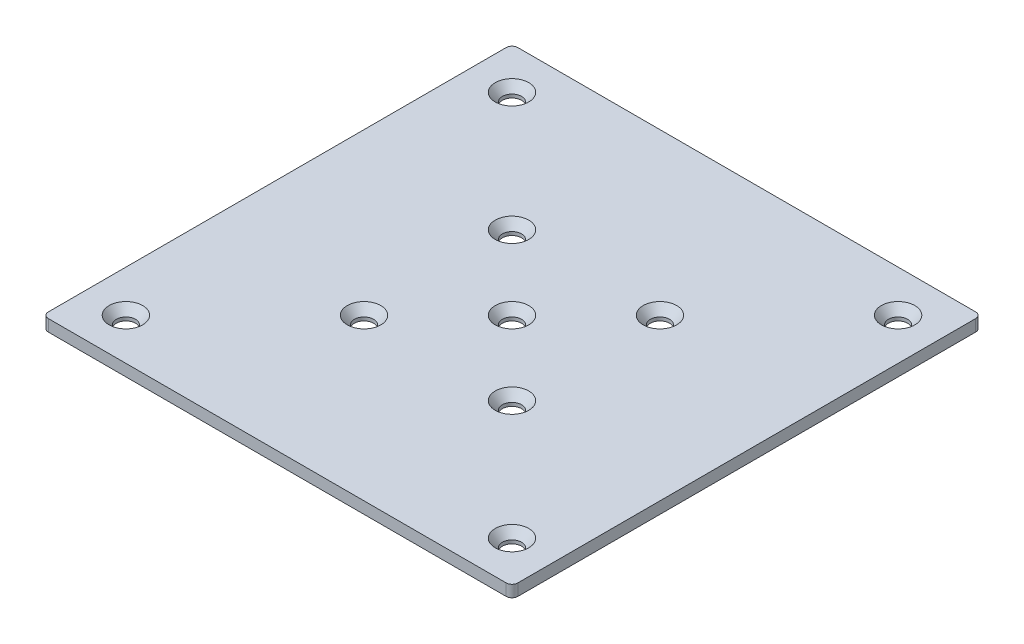
ISO-10303-21;
HEADER;
FILE_DESCRIPTION(('STEP AP214'),'2;1');
FILE_NAME('part.step','',(''),(''),'','','');
FILE_SCHEMA(('AUTOMOTIVE_DESIGN { 1 0 10303 214 1 1 1 1 }'));
ENDSEC;
DATA;
#1=APPLICATION_CONTEXT('core data for automotive mechanical design processes');
#2=APPLICATION_PROTOCOL_DEFINITION('international standard','automotive_design',2000,#1);
#3=PRODUCT_CONTEXT('',#1,'mechanical');
#4=PRODUCT('Part','Part','',(#3));
#5=PRODUCT_RELATED_PRODUCT_CATEGORY('part','',(#4));
#6=PRODUCT_DEFINITION_FORMATION('','',#4);
#7=PRODUCT_DEFINITION_CONTEXT('part definition',#1,'design');
#8=PRODUCT_DEFINITION('design','',#6,#7);
#9=PRODUCT_DEFINITION_SHAPE('','',#8);
#10=(LENGTH_UNIT() NAMED_UNIT(*) SI_UNIT(.MILLI.,.METRE.));
#11=(NAMED_UNIT(*) PLANE_ANGLE_UNIT() SI_UNIT($,.RADIAN.));
#12=(NAMED_UNIT(*) SI_UNIT($,.STERADIAN.) SOLID_ANGLE_UNIT());
#13=UNCERTAINTY_MEASURE_WITH_UNIT(LENGTH_MEASURE(1.E-05),#10,'distance_accuracy_value','');
#14=(GEOMETRIC_REPRESENTATION_CONTEXT(3) GLOBAL_UNCERTAINTY_ASSIGNED_CONTEXT((#13)) GLOBAL_UNIT_ASSIGNED_CONTEXT((#10,
#11,#12)) REPRESENTATION_CONTEXT('',''));
#15=CARTESIAN_POINT('',(0.,0.,0.));
#16=DIRECTION('',(0.,0.,1.));
#17=DIRECTION('',(1.,0.,0.));
#18=AXIS2_PLACEMENT_3D('',#15,#16,#17);
#19=CARTESIAN_POINT('',(40.,2.,40.));
#20=DIRECTION('',(-1.,0.,0.));
#21=DIRECTION('',(0.,0.,1.));
#22=AXIS2_PLACEMENT_3D('',#19,#20,#21);
#23=PLANE('',#22);
#24=DIRECTION('',(0.,0.,-1.));
#25=VECTOR('',#24,1.);
#26=CARTESIAN_POINT('',(40.,2.,40.));
#27=LINE('',#26,#25);
#28=CARTESIAN_POINT('',(40.,2.,39.));
#29=VERTEX_POINT('',#28);
#30=CARTESIAN_POINT('',(40.,2.,-39.));
#31=VERTEX_POINT('',#30);
#32=EDGE_CURVE('E123',#29,#31,#27,.T.);
#33=ORIENTED_EDGE('',*,*,#32,.F.);
#34=DIRECTION('',(0.,-1.,0.));
#35=VECTOR('',#34,1.);
#36=CARTESIAN_POINT('',(40.,2.,39.));
#37=LINE('',#36,#35);
#38=CARTESIAN_POINT('',(40.,0.,39.));
#39=VERTEX_POINT('',#38);
#40=EDGE_CURVE('E137',#29,#39,#37,.T.);
#41=ORIENTED_EDGE('',*,*,#40,.T.);
#42=DIRECTION('',(0.,0.,-1.));
#43=VECTOR('',#42,1.);
#44=CARTESIAN_POINT('',(40.,0.,40.));
#45=LINE('',#44,#43);
#46=CARTESIAN_POINT('',(40.,0.,-39.));
#47=VERTEX_POINT('',#46);
#48=EDGE_CURVE('E158',#39,#47,#45,.T.);
#49=ORIENTED_EDGE('',*,*,#48,.T.);
#50=DIRECTION('',(0.,-1.,0.));
#51=VECTOR('',#50,1.);
#52=CARTESIAN_POINT('',(40.,2.,-39.));
#53=LINE('',#52,#51);
#54=EDGE_CURVE('E135',#47,#31,#53,.F.);
#55=ORIENTED_EDGE('',*,*,#54,.T.);
#56=EDGE_LOOP('',(#33,#41,#49,#55));
#57=FACE_BOUND('',#56,.T.);
#58=ADVANCED_FACE('F32',(#57),#23,.F.);
#59=CARTESIAN_POINT('',(-40.,2.,-40.));
#60=DIRECTION('',(0.,0.,1.));
#61=DIRECTION('',(1.,0.,0.));
#62=AXIS2_PLACEMENT_3D('',#59,#60,#61);
#63=PLANE('',#62);
#64=DIRECTION('',(-1.,0.,0.));
#65=VECTOR('',#64,1.);
#66=CARTESIAN_POINT('',(-40.,2.,-40.));
#67=LINE('',#66,#65);
#68=CARTESIAN_POINT('',(39.,2.,-40.));
#69=VERTEX_POINT('',#68);
#70=CARTESIAN_POINT('',(-39.,2.,-40.));
#71=VERTEX_POINT('',#70);
#72=EDGE_CURVE('E126',#69,#71,#67,.T.);
#73=ORIENTED_EDGE('',*,*,#72,.F.);
#74=DIRECTION('',(0.,-1.,0.));
#75=VECTOR('',#74,1.);
#76=CARTESIAN_POINT('',(39.,2.,-40.));
#77=LINE('',#76,#75);
#78=CARTESIAN_POINT('',(39.,0.,-40.));
#79=VERTEX_POINT('',#78);
#80=EDGE_CURVE('E40',#69,#79,#77,.T.);
#81=ORIENTED_EDGE('',*,*,#80,.T.);
#82=DIRECTION('',(-1.,0.,0.));
#83=VECTOR('',#82,1.);
#84=CARTESIAN_POINT('',(-40.,0.,-40.));
#85=LINE('',#84,#83);
#86=CARTESIAN_POINT('',(-39.,0.,-40.));
#87=VERTEX_POINT('',#86);
#88=EDGE_CURVE('E128',#79,#87,#85,.T.);
#89=ORIENTED_EDGE('',*,*,#88,.T.);
#90=DIRECTION('',(0.,-1.,0.));
#91=VECTOR('',#90,1.);
#92=CARTESIAN_POINT('',(-39.,2.,-40.));
#93=LINE('',#92,#91);
#94=EDGE_CURVE('E47',#87,#71,#93,.F.);
#95=ORIENTED_EDGE('',*,*,#94,.T.);
#96=EDGE_LOOP('',(#73,#81,#89,#95));
#97=FACE_BOUND('',#96,.T.);
#98=ADVANCED_FACE('F155',(#97),#63,.F.);
#99=CARTESIAN_POINT('',(-40.,2.,40.));
#100=DIRECTION('',(1.,0.,0.));
#101=DIRECTION('',(0.,0.,-1.));
#102=AXIS2_PLACEMENT_3D('',#99,#100,#101);
#103=PLANE('',#102);
#104=DIRECTION('',(0.,0.,1.));
#105=VECTOR('',#104,1.);
#106=CARTESIAN_POINT('',(-40.,2.,40.));
#107=LINE('',#106,#105);
#108=CARTESIAN_POINT('',(-40.,2.,-39.));
#109=VERTEX_POINT('',#108);
#110=CARTESIAN_POINT('',(-40.,2.,39.));
#111=VERTEX_POINT('',#110);
#112=EDGE_CURVE('E163',#109,#111,#107,.T.);
#113=ORIENTED_EDGE('',*,*,#112,.F.);
#114=DIRECTION('',(0.,-1.,0.));
#115=VECTOR('',#114,1.);
#116=CARTESIAN_POINT('',(-40.,2.,-39.));
#117=LINE('',#116,#115);
#118=CARTESIAN_POINT('',(-40.,0.,-39.));
#119=VERTEX_POINT('',#118);
#120=EDGE_CURVE('E11',#109,#119,#117,.T.);
#121=ORIENTED_EDGE('',*,*,#120,.T.);
#122=DIRECTION('',(0.,0.,1.));
#123=VECTOR('',#122,1.);
#124=CARTESIAN_POINT('',(-40.,0.,40.));
#125=LINE('',#124,#123);
#126=CARTESIAN_POINT('',(-40.,0.,39.));
#127=VERTEX_POINT('',#126);
#128=EDGE_CURVE('E124',#119,#127,#125,.T.);
#129=ORIENTED_EDGE('',*,*,#128,.T.);
#130=DIRECTION('',(0.,-1.,0.));
#131=VECTOR('',#130,1.);
#132=CARTESIAN_POINT('',(-40.,2.,39.));
#133=LINE('',#132,#131);
#134=EDGE_CURVE('E106',#127,#111,#133,.F.);
#135=ORIENTED_EDGE('',*,*,#134,.T.);
#136=EDGE_LOOP('',(#113,#121,#129,#135));
#137=FACE_BOUND('',#136,.T.);
#138=ADVANCED_FACE('F288',(#137),#103,.F.);
#139=CARTESIAN_POINT('',(-40.,2.,40.));
#140=DIRECTION('',(0.,0.,-1.));
#141=DIRECTION('',(-1.,0.,0.));
#142=AXIS2_PLACEMENT_3D('',#139,#140,#141);
#143=PLANE('',#142);
#144=DIRECTION('',(1.,0.,0.));
#145=VECTOR('',#144,1.);
#146=CARTESIAN_POINT('',(-40.,0.,40.));
#147=LINE('',#146,#145);
#148=CARTESIAN_POINT('',(-39.,0.,40.));
#149=VERTEX_POINT('',#148);
#150=CARTESIAN_POINT('',(39.,0.,40.));
#151=VERTEX_POINT('',#150);
#152=EDGE_CURVE('E115',#149,#151,#147,.T.);
#153=ORIENTED_EDGE('',*,*,#152,.T.);
#154=DIRECTION('',(0.,-1.,0.));
#155=VECTOR('',#154,1.);
#156=CARTESIAN_POINT('',(39.,2.,40.));
#157=LINE('',#156,#155);
#158=CARTESIAN_POINT('',(39.,2.,40.));
#159=VERTEX_POINT('',#158);
#160=EDGE_CURVE('E145',#151,#159,#157,.F.);
#161=ORIENTED_EDGE('',*,*,#160,.T.);
#162=DIRECTION('',(1.,0.,0.));
#163=VECTOR('',#162,1.);
#164=CARTESIAN_POINT('',(-40.,2.,40.));
#165=LINE('',#164,#163);
#166=CARTESIAN_POINT('',(-39.,2.,40.));
#167=VERTEX_POINT('',#166);
#168=EDGE_CURVE('E118',#167,#159,#165,.T.);
#169=ORIENTED_EDGE('',*,*,#168,.F.);
#170=DIRECTION('',(0.,-1.,0.));
#171=VECTOR('',#170,1.);
#172=CARTESIAN_POINT('',(-39.,2.,40.));
#173=LINE('',#172,#171);
#174=EDGE_CURVE('E104',#167,#149,#173,.T.);
#175=ORIENTED_EDGE('',*,*,#174,.T.);
#176=EDGE_LOOP('',(#153,#161,#169,#175));
#177=FACE_BOUND('',#176,.T.);
#178=ADVANCED_FACE('F114',(#177),#143,.F.);
#179=CARTESIAN_POINT('',(0.,2.,0.));
#180=DIRECTION('',(0.,-1.,0.));
#181=DIRECTION('',(0.,0.,-1.));
#182=AXIS2_PLACEMENT_3D('',#179,#180,#181);
#183=PLANE('',#182);
#184=CARTESIAN_POINT('',(-12.6062890369737,2.,-12.6062890369738));
#185=DIRECTION('',(0.,1.,0.));
#186=DIRECTION('',(0.,0.,1.));
#187=AXIS2_PLACEMENT_3D('',#184,#185,#186);
#188=CIRCLE('',#187,2.8575);
#189=CARTESIAN_POINT('',(-12.6062890369737,2.,-9.74878903697375));
#190=VERTEX_POINT('',#189);
#191=EDGE_CURVE('E243',#190,#190,#188,.T.);
#192=ORIENTED_EDGE('',*,*,#191,.F.);
#193=EDGE_LOOP('',(#192));
#194=FACE_BOUND('',#193,.T.);
#195=CARTESIAN_POINT('',(12.6062890369738,2.,-12.6062890369738));
#196=DIRECTION('',(0.,1.,0.));
#197=DIRECTION('',(0.,0.,1.));
#198=AXIS2_PLACEMENT_3D('',#195,#196,#197);
#199=CIRCLE('',#198,2.8575);
#200=CARTESIAN_POINT('',(12.6062890369738,2.,-9.74878903697375));
#201=VERTEX_POINT('',#200);
#202=EDGE_CURVE('E234',#201,#201,#199,.T.);
#203=ORIENTED_EDGE('',*,*,#202,.F.);
#204=EDGE_LOOP('',(#203));
#205=FACE_BOUND('',#204,.T.);
#206=CARTESIAN_POINT('',(12.6062890369738,2.,12.6062890369737));
#207=DIRECTION('',(0.,1.,0.));
#208=DIRECTION('',(0.,0.,1.));
#209=AXIS2_PLACEMENT_3D('',#206,#207,#208);
#210=CIRCLE('',#209,2.8575);
#211=CARTESIAN_POINT('',(12.6062890369738,2.,15.4637890369737));
#212=VERTEX_POINT('',#211);
#213=EDGE_CURVE('E225',#212,#212,#210,.T.);
#214=ORIENTED_EDGE('',*,*,#213,.F.);
#215=EDGE_LOOP('',(#214));
#216=FACE_BOUND('',#215,.T.);
#217=CARTESIAN_POINT('',(-12.6062890369737,2.,12.6062890369737));
#218=DIRECTION('',(0.,1.,0.));
#219=DIRECTION('',(0.,0.,1.));
#220=AXIS2_PLACEMENT_3D('',#217,#218,#219);
#221=CIRCLE('',#220,2.8575);
#222=CARTESIAN_POINT('',(-12.6062890369737,2.,15.4637890369737));
#223=VERTEX_POINT('',#222);
#224=EDGE_CURVE('E216',#223,#223,#221,.T.);
#225=ORIENTED_EDGE('',*,*,#224,.F.);
#226=EDGE_LOOP('',(#225));
#227=FACE_BOUND('',#226,.T.);
#228=CARTESIAN_POINT('',(0.,2.,0.));
#229=DIRECTION('',(0.,1.,0.));
#230=DIRECTION('',(0.,0.,1.));
#231=AXIS2_PLACEMENT_3D('',#228,#229,#230);
#232=CIRCLE('',#231,2.8575);
#233=CARTESIAN_POINT('',(0.,2.,2.8575));
#234=VERTEX_POINT('',#233);
#235=EDGE_CURVE('E207',#234,#234,#232,.T.);
#236=ORIENTED_EDGE('',*,*,#235,.F.);
#237=EDGE_LOOP('',(#236));
#238=FACE_BOUND('',#237,.T.);
#239=CARTESIAN_POINT('',(-32.897493012403,2.,-32.897493012403));
#240=DIRECTION('',(0.,1.,0.));
#241=DIRECTION('',(0.,0.,1.));
#242=AXIS2_PLACEMENT_3D('',#239,#240,#241);
#243=CIRCLE('',#242,2.8575);
#244=CARTESIAN_POINT('',(-32.897493012403,2.,-30.039993012403));
#245=VERTEX_POINT('',#244);
#246=EDGE_CURVE('E198',#245,#245,#243,.T.);
#247=ORIENTED_EDGE('',*,*,#246,.F.);
#248=EDGE_LOOP('',(#247));
#249=FACE_BOUND('',#248,.T.);
#250=CARTESIAN_POINT('',(32.897493012403,2.,-32.897493012403));
#251=DIRECTION('',(0.,1.,0.));
#252=DIRECTION('',(0.,0.,1.));
#253=AXIS2_PLACEMENT_3D('',#250,#251,#252);
#254=CIRCLE('',#253,2.8575);
#255=CARTESIAN_POINT('',(32.897493012403,2.,-30.039993012403));
#256=VERTEX_POINT('',#255);
#257=EDGE_CURVE('E189',#256,#256,#254,.T.);
#258=ORIENTED_EDGE('',*,*,#257,.F.);
#259=EDGE_LOOP('',(#258));
#260=FACE_BOUND('',#259,.T.);
#261=CARTESIAN_POINT('',(32.897493012403,2.,32.897493012403));
#262=DIRECTION('',(0.,1.,0.));
#263=DIRECTION('',(0.,0.,1.));
#264=AXIS2_PLACEMENT_3D('',#261,#262,#263);
#265=CIRCLE('',#264,2.8575);
#266=CARTESIAN_POINT('',(32.897493012403,2.,35.754993012403));
#267=VERTEX_POINT('',#266);
#268=EDGE_CURVE('E180',#267,#267,#265,.T.);
#269=ORIENTED_EDGE('',*,*,#268,.F.);
#270=EDGE_LOOP('',(#269));
#271=FACE_BOUND('',#270,.T.);
#272=CARTESIAN_POINT('',(-32.897493012403,2.,32.897493012403));
#273=DIRECTION('',(0.,1.,0.));
#274=DIRECTION('',(0.,0.,1.));
#275=AXIS2_PLACEMENT_3D('',#272,#273,#274);
#276=CIRCLE('',#275,2.8575);
#277=CARTESIAN_POINT('',(-32.897493012403,2.,35.754993012403));
#278=VERTEX_POINT('',#277);
#279=EDGE_CURVE('E171',#278,#278,#276,.T.);
#280=ORIENTED_EDGE('',*,*,#279,.F.);
#281=EDGE_LOOP('',(#280));
#282=FACE_BOUND('',#281,.T.);
#283=ORIENTED_EDGE('',*,*,#168,.T.);
#284=CARTESIAN_POINT('',(39.,2.,39.));
#285=DIRECTION('',(0.,-1.,0.));
#286=DIRECTION('',(0.,0.,-1.));
#287=AXIS2_PLACEMENT_3D('',#284,#285,#286);
#288=CIRCLE('',#287,1.);
#289=EDGE_CURVE('E150',#159,#29,#288,.F.);
#290=ORIENTED_EDGE('',*,*,#289,.T.);
#291=ORIENTED_EDGE('',*,*,#32,.T.);
#292=CARTESIAN_POINT('',(39.,2.,-39.));
#293=DIRECTION('',(0.,-1.,0.));
#294=DIRECTION('',(0.,0.,-1.));
#295=AXIS2_PLACEMENT_3D('',#292,#293,#294);
#296=CIRCLE('',#295,1.);
#297=EDGE_CURVE('E54',#31,#69,#296,.F.);
#298=ORIENTED_EDGE('',*,*,#297,.T.);
#299=ORIENTED_EDGE('',*,*,#72,.T.);
#300=CARTESIAN_POINT('',(-39.,2.,-39.));
#301=DIRECTION('',(0.,-1.,0.));
#302=DIRECTION('',(0.,0.,-1.));
#303=AXIS2_PLACEMENT_3D('',#300,#301,#302);
#304=CIRCLE('',#303,1.);
#305=EDGE_CURVE('E147',#71,#109,#304,.F.);
#306=ORIENTED_EDGE('',*,*,#305,.T.);
#307=ORIENTED_EDGE('',*,*,#112,.T.);
#308=CARTESIAN_POINT('',(-39.,2.,39.));
#309=DIRECTION('',(0.,-1.,0.));
#310=DIRECTION('',(0.,0.,-1.));
#311=AXIS2_PLACEMENT_3D('',#308,#309,#310);
#312=CIRCLE('',#311,1.);
#313=EDGE_CURVE('E133',#111,#167,#312,.F.);
#314=ORIENTED_EDGE('',*,*,#313,.T.);
#315=EDGE_LOOP('',(#283,#290,#291,#298,#299,#306,#307,#314));
#316=FACE_BOUND('',#315,.T.);
#317=ADVANCED_FACE('F249',(#194,#205,#216,#227,#238,#249,#260,#271,#282,#316),#183,.F.);
#318=CARTESIAN_POINT('',(0.,0.,0.));
#319=DIRECTION('',(0.,-1.,0.));
#320=DIRECTION('',(0.,0.,-1.));
#321=AXIS2_PLACEMENT_3D('',#318,#319,#320);
#322=PLANE('',#321);
#323=CARTESIAN_POINT('',(-12.6062890369737,0.,-12.6062890369738));
#324=DIRECTION('',(0.,1.,0.));
#325=DIRECTION('',(0.,0.,1.));
#326=AXIS2_PLACEMENT_3D('',#323,#324,#325);
#327=CIRCLE('',#326,1.63195);
#328=CARTESIAN_POINT('',(-12.6062890369737,0.,-10.9743390369738));
#329=VERTEX_POINT('',#328);
#330=EDGE_CURVE('E237',#329,#329,#327,.T.);
#331=ORIENTED_EDGE('',*,*,#330,.T.);
#332=EDGE_LOOP('',(#331));
#333=FACE_BOUND('',#332,.T.);
#334=CARTESIAN_POINT('',(12.6062890369738,0.,-12.6062890369738));
#335=DIRECTION('',(0.,1.,0.));
#336=DIRECTION('',(0.,0.,1.));
#337=AXIS2_PLACEMENT_3D('',#334,#335,#336);
#338=CIRCLE('',#337,1.63195);
#339=CARTESIAN_POINT('',(12.6062890369738,0.,-10.9743390369738));
#340=VERTEX_POINT('',#339);
#341=EDGE_CURVE('E228',#340,#340,#338,.T.);
#342=ORIENTED_EDGE('',*,*,#341,.T.);
#343=EDGE_LOOP('',(#342));
#344=FACE_BOUND('',#343,.T.);
#345=CARTESIAN_POINT('',(12.6062890369738,0.,12.6062890369737));
#346=DIRECTION('',(0.,1.,0.));
#347=DIRECTION('',(0.,0.,1.));
#348=AXIS2_PLACEMENT_3D('',#345,#346,#347);
#349=CIRCLE('',#348,1.63195);
#350=CARTESIAN_POINT('',(12.6062890369738,0.,14.2382390369737));
#351=VERTEX_POINT('',#350);
#352=EDGE_CURVE('E219',#351,#351,#349,.T.);
#353=ORIENTED_EDGE('',*,*,#352,.T.);
#354=EDGE_LOOP('',(#353));
#355=FACE_BOUND('',#354,.T.);
#356=CARTESIAN_POINT('',(-12.6062890369737,0.,12.6062890369737));
#357=DIRECTION('',(0.,1.,0.));
#358=DIRECTION('',(0.,0.,1.));
#359=AXIS2_PLACEMENT_3D('',#356,#357,#358);
#360=CIRCLE('',#359,1.63195);
#361=CARTESIAN_POINT('',(-12.6062890369737,0.,14.2382390369737));
#362=VERTEX_POINT('',#361);
#363=EDGE_CURVE('E210',#362,#362,#360,.T.);
#364=ORIENTED_EDGE('',*,*,#363,.T.);
#365=EDGE_LOOP('',(#364));
#366=FACE_BOUND('',#365,.T.);
#367=CARTESIAN_POINT('',(0.,0.,0.));
#368=DIRECTION('',(0.,1.,0.));
#369=DIRECTION('',(0.,0.,1.));
#370=AXIS2_PLACEMENT_3D('',#367,#368,#369);
#371=CIRCLE('',#370,1.63195);
#372=CARTESIAN_POINT('',(0.,0.,1.63195));
#373=VERTEX_POINT('',#372);
#374=EDGE_CURVE('E201',#373,#373,#371,.T.);
#375=ORIENTED_EDGE('',*,*,#374,.T.);
#376=EDGE_LOOP('',(#375));
#377=FACE_BOUND('',#376,.T.);
#378=CARTESIAN_POINT('',(-32.897493012403,0.,-32.897493012403));
#379=DIRECTION('',(0.,1.,0.));
#380=DIRECTION('',(0.,0.,1.));
#381=AXIS2_PLACEMENT_3D('',#378,#379,#380);
#382=CIRCLE('',#381,1.63195);
#383=CARTESIAN_POINT('',(-32.897493012403,0.,-31.265543012403));
#384=VERTEX_POINT('',#383);
#385=EDGE_CURVE('E192',#384,#384,#382,.T.);
#386=ORIENTED_EDGE('',*,*,#385,.T.);
#387=EDGE_LOOP('',(#386));
#388=FACE_BOUND('',#387,.T.);
#389=CARTESIAN_POINT('',(32.897493012403,0.,-32.897493012403));
#390=DIRECTION('',(0.,1.,0.));
#391=DIRECTION('',(0.,0.,1.));
#392=AXIS2_PLACEMENT_3D('',#389,#390,#391);
#393=CIRCLE('',#392,1.63195);
#394=CARTESIAN_POINT('',(32.897493012403,0.,-31.265543012403));
#395=VERTEX_POINT('',#394);
#396=EDGE_CURVE('E183',#395,#395,#393,.T.);
#397=ORIENTED_EDGE('',*,*,#396,.T.);
#398=EDGE_LOOP('',(#397));
#399=FACE_BOUND('',#398,.T.);
#400=CARTESIAN_POINT('',(32.897493012403,0.,32.897493012403));
#401=DIRECTION('',(0.,1.,0.));
#402=DIRECTION('',(0.,0.,1.));
#403=AXIS2_PLACEMENT_3D('',#400,#401,#402);
#404=CIRCLE('',#403,1.63195);
#405=CARTESIAN_POINT('',(32.897493012403,0.,34.529443012403));
#406=VERTEX_POINT('',#405);
#407=EDGE_CURVE('E174',#406,#406,#404,.T.);
#408=ORIENTED_EDGE('',*,*,#407,.T.);
#409=EDGE_LOOP('',(#408));
#410=FACE_BOUND('',#409,.T.);
#411=CARTESIAN_POINT('',(-32.897493012403,0.,32.897493012403));
#412=DIRECTION('',(0.,1.,0.));
#413=DIRECTION('',(0.,0.,1.));
#414=AXIS2_PLACEMENT_3D('',#411,#412,#413);
#415=CIRCLE('',#414,1.63195);
#416=CARTESIAN_POINT('',(-32.897493012403,0.,34.529443012403));
#417=VERTEX_POINT('',#416);
#418=EDGE_CURVE('E159',#417,#417,#415,.T.);
#419=ORIENTED_EDGE('',*,*,#418,.T.);
#420=EDGE_LOOP('',(#419));
#421=FACE_BOUND('',#420,.T.);
#422=ORIENTED_EDGE('',*,*,#48,.F.);
#423=CARTESIAN_POINT('',(39.,0.,39.));
#424=DIRECTION('',(0.,-1.,0.));
#425=DIRECTION('',(0.,0.,-1.));
#426=AXIS2_PLACEMENT_3D('',#423,#424,#425);
#427=CIRCLE('',#426,1.);
#428=EDGE_CURVE('E122',#39,#151,#427,.T.);
#429=ORIENTED_EDGE('',*,*,#428,.T.);
#430=ORIENTED_EDGE('',*,*,#152,.F.);
#431=CARTESIAN_POINT('',(-39.,0.,39.));
#432=DIRECTION('',(0.,-1.,0.));
#433=DIRECTION('',(0.,0.,-1.));
#434=AXIS2_PLACEMENT_3D('',#431,#432,#433);
#435=CIRCLE('',#434,1.);
#436=EDGE_CURVE('E100',#149,#127,#435,.T.);
#437=ORIENTED_EDGE('',*,*,#436,.T.);
#438=ORIENTED_EDGE('',*,*,#128,.F.);
#439=CARTESIAN_POINT('',(-39.,0.,-39.));
#440=DIRECTION('',(0.,-1.,0.));
#441=DIRECTION('',(0.,0.,-1.));
#442=AXIS2_PLACEMENT_3D('',#439,#440,#441);
#443=CIRCLE('',#442,1.);
#444=EDGE_CURVE('E140',#119,#87,#443,.T.);
#445=ORIENTED_EDGE('',*,*,#444,.T.);
#446=ORIENTED_EDGE('',*,*,#88,.F.);
#447=CARTESIAN_POINT('',(39.,0.,-39.));
#448=DIRECTION('',(0.,-1.,0.));
#449=DIRECTION('',(0.,0.,-1.));
#450=AXIS2_PLACEMENT_3D('',#447,#448,#449);
#451=CIRCLE('',#450,1.);
#452=EDGE_CURVE('E142',#79,#47,#451,.T.);
#453=ORIENTED_EDGE('',*,*,#452,.T.);
#454=EDGE_LOOP('',(#422,#429,#430,#437,#438,#445,#446,#453));
#455=FACE_BOUND('',#454,.T.);
#456=ADVANCED_FACE('F121',(#333,#344,#355,#366,#377,#388,#399,#410,#421,#455),#322,.T.);
#457=CARTESIAN_POINT('',(-32.897493012403,2.,32.897493012403));
#458=DIRECTION('',(0.,1.,0.));
#459=DIRECTION('',(0.,0.,1.));
#460=AXIS2_PLACEMENT_3D('',#457,#458,#459);
#461=CYLINDRICAL_SURFACE('',#460,1.63195);
#462=ORIENTED_EDGE('',*,*,#418,.F.);
#463=EDGE_LOOP('',(#462));
#464=FACE_BOUND('',#463,.T.);
#465=CARTESIAN_POINT('',(-32.897493012403,0.590165998530295,32.897493012403));
#466=DIRECTION('',(0.,1.,0.));
#467=DIRECTION('',(0.,0.,1.));
#468=AXIS2_PLACEMENT_3D('',#465,#466,#467);
#469=CIRCLE('',#468,1.63195);
#470=CARTESIAN_POINT('',(-32.897493012403,0.590165998530295,34.529443012403));
#471=VERTEX_POINT('',#470);
#472=EDGE_CURVE('E168',#471,#471,#469,.T.);
#473=ORIENTED_EDGE('',*,*,#472,.T.);
#474=EDGE_LOOP('',(#473));
#475=FACE_BOUND('',#474,.T.);
#476=ADVANCED_FACE('F365',(#464,#475),#461,.F.);
#477=CARTESIAN_POINT('',(-32.897493012403,2.,32.897493012403));
#478=DIRECTION('',(0.,1.,0.));
#479=DIRECTION('',(0.,0.,1.));
#480=AXIS2_PLACEMENT_3D('',#477,#478,#479);
#481=CONICAL_SURFACE('',#480,2.8575,0.715584993317676);
#482=ORIENTED_EDGE('',*,*,#472,.F.);
#483=EDGE_LOOP('',(#482));
#484=FACE_BOUND('',#483,.T.);
#485=ORIENTED_EDGE('',*,*,#279,.T.);
#486=EDGE_LOOP('',(#485));
#487=FACE_BOUND('',#486,.T.);
#488=ADVANCED_FACE('F361',(#484,#487),#481,.F.);
#489=CARTESIAN_POINT('',(32.897493012403,2.,32.897493012403));
#490=DIRECTION('',(0.,1.,0.));
#491=DIRECTION('',(0.,0.,1.));
#492=AXIS2_PLACEMENT_3D('',#489,#490,#491);
#493=CYLINDRICAL_SURFACE('',#492,1.63195);
#494=ORIENTED_EDGE('',*,*,#407,.F.);
#495=EDGE_LOOP('',(#494));
#496=FACE_BOUND('',#495,.T.);
#497=CARTESIAN_POINT('',(32.897493012403,0.590165998530295,32.897493012403));
#498=DIRECTION('',(0.,1.,0.));
#499=DIRECTION('',(0.,0.,1.));
#500=AXIS2_PLACEMENT_3D('',#497,#498,#499);
#501=CIRCLE('',#500,1.63195);
#502=CARTESIAN_POINT('',(32.897493012403,0.590165998530295,34.529443012403));
#503=VERTEX_POINT('',#502);
#504=EDGE_CURVE('E177',#503,#503,#501,.T.);
#505=ORIENTED_EDGE('',*,*,#504,.T.);
#506=EDGE_LOOP('',(#505));
#507=FACE_BOUND('',#506,.T.);
#508=ADVANCED_FACE('F357',(#496,#507),#493,.F.);
#509=CARTESIAN_POINT('',(32.897493012403,2.,32.897493012403));
#510=DIRECTION('',(0.,1.,0.));
#511=DIRECTION('',(0.,0.,1.));
#512=AXIS2_PLACEMENT_3D('',#509,#510,#511);
#513=CONICAL_SURFACE('',#512,2.8575,0.715584993317676);
#514=ORIENTED_EDGE('',*,*,#504,.F.);
#515=EDGE_LOOP('',(#514));
#516=FACE_BOUND('',#515,.T.);
#517=ORIENTED_EDGE('',*,*,#268,.T.);
#518=EDGE_LOOP('',(#517));
#519=FACE_BOUND('',#518,.T.);
#520=ADVANCED_FACE('F353',(#516,#519),#513,.F.);
#521=CARTESIAN_POINT('',(32.897493012403,2.,-32.897493012403));
#522=DIRECTION('',(0.,1.,0.));
#523=DIRECTION('',(0.,0.,1.));
#524=AXIS2_PLACEMENT_3D('',#521,#522,#523);
#525=CYLINDRICAL_SURFACE('',#524,1.63195);
#526=ORIENTED_EDGE('',*,*,#396,.F.);
#527=EDGE_LOOP('',(#526));
#528=FACE_BOUND('',#527,.T.);
#529=CARTESIAN_POINT('',(32.897493012403,0.590165998530295,-32.897493012403));
#530=DIRECTION('',(0.,1.,0.));
#531=DIRECTION('',(0.,0.,1.));
#532=AXIS2_PLACEMENT_3D('',#529,#530,#531);
#533=CIRCLE('',#532,1.63195);
#534=CARTESIAN_POINT('',(32.897493012403,0.590165998530295,-31.265543012403));
#535=VERTEX_POINT('',#534);
#536=EDGE_CURVE('E186',#535,#535,#533,.T.);
#537=ORIENTED_EDGE('',*,*,#536,.T.);
#538=EDGE_LOOP('',(#537));
#539=FACE_BOUND('',#538,.T.);
#540=ADVANCED_FACE('F349',(#528,#539),#525,.F.);
#541=CARTESIAN_POINT('',(32.897493012403,2.,-32.897493012403));
#542=DIRECTION('',(0.,1.,0.));
#543=DIRECTION('',(0.,0.,1.));
#544=AXIS2_PLACEMENT_3D('',#541,#542,#543);
#545=CONICAL_SURFACE('',#544,2.8575,0.715584993317676);
#546=ORIENTED_EDGE('',*,*,#536,.F.);
#547=EDGE_LOOP('',(#546));
#548=FACE_BOUND('',#547,.T.);
#549=ORIENTED_EDGE('',*,*,#257,.T.);
#550=EDGE_LOOP('',(#549));
#551=FACE_BOUND('',#550,.T.);
#552=ADVANCED_FACE('F345',(#548,#551),#545,.F.);
#553=CARTESIAN_POINT('',(-32.897493012403,2.,-32.897493012403));
#554=DIRECTION('',(0.,1.,0.));
#555=DIRECTION('',(0.,0.,1.));
#556=AXIS2_PLACEMENT_3D('',#553,#554,#555);
#557=CYLINDRICAL_SURFACE('',#556,1.63195);
#558=ORIENTED_EDGE('',*,*,#385,.F.);
#559=EDGE_LOOP('',(#558));
#560=FACE_BOUND('',#559,.T.);
#561=CARTESIAN_POINT('',(-32.897493012403,0.590165998530295,-32.897493012403));
#562=DIRECTION('',(0.,1.,0.));
#563=DIRECTION('',(0.,0.,1.));
#564=AXIS2_PLACEMENT_3D('',#561,#562,#563);
#565=CIRCLE('',#564,1.63195);
#566=CARTESIAN_POINT('',(-32.897493012403,0.590165998530295,-31.265543012403));
#567=VERTEX_POINT('',#566);
#568=EDGE_CURVE('E195',#567,#567,#565,.T.);
#569=ORIENTED_EDGE('',*,*,#568,.T.);
#570=EDGE_LOOP('',(#569));
#571=FACE_BOUND('',#570,.T.);
#572=ADVANCED_FACE('F341',(#560,#571),#557,.F.);
#573=CARTESIAN_POINT('',(-32.897493012403,2.,-32.897493012403));
#574=DIRECTION('',(0.,1.,0.));
#575=DIRECTION('',(0.,0.,1.));
#576=AXIS2_PLACEMENT_3D('',#573,#574,#575);
#577=CONICAL_SURFACE('',#576,2.8575,0.715584993317676);
#578=ORIENTED_EDGE('',*,*,#568,.F.);
#579=EDGE_LOOP('',(#578));
#580=FACE_BOUND('',#579,.T.);
#581=ORIENTED_EDGE('',*,*,#246,.T.);
#582=EDGE_LOOP('',(#581));
#583=FACE_BOUND('',#582,.T.);
#584=ADVANCED_FACE('F337',(#580,#583),#577,.F.);
#585=CARTESIAN_POINT('',(0.,2.,0.));
#586=DIRECTION('',(0.,1.,0.));
#587=DIRECTION('',(0.,0.,1.));
#588=AXIS2_PLACEMENT_3D('',#585,#586,#587);
#589=CYLINDRICAL_SURFACE('',#588,1.63194999999999);
#590=ORIENTED_EDGE('',*,*,#374,.F.);
#591=EDGE_LOOP('',(#590));
#592=FACE_BOUND('',#591,.T.);
#593=CARTESIAN_POINT('',(0.,0.59016599853026,0.));
#594=DIRECTION('',(0.,1.,0.));
#595=DIRECTION('',(0.,0.,1.));
#596=AXIS2_PLACEMENT_3D('',#593,#594,#595);
#597=CIRCLE('',#596,1.63194999999999);
#598=CARTESIAN_POINT('',(0.,0.59016599853026,1.63194999999999));
#599=VERTEX_POINT('',#598);
#600=EDGE_CURVE('E204',#599,#599,#597,.T.);
#601=ORIENTED_EDGE('',*,*,#600,.T.);
#602=EDGE_LOOP('',(#601));
#603=FACE_BOUND('',#602,.T.);
#604=ADVANCED_FACE('F333',(#592,#603),#589,.F.);
#605=CARTESIAN_POINT('',(0.,2.,0.));
#606=DIRECTION('',(0.,1.,0.));
#607=DIRECTION('',(0.,0.,1.));
#608=AXIS2_PLACEMENT_3D('',#605,#606,#607);
#609=CONICAL_SURFACE('',#608,2.8575,0.715584993317668);
#610=ORIENTED_EDGE('',*,*,#600,.F.);
#611=EDGE_LOOP('',(#610));
#612=FACE_BOUND('',#611,.T.);
#613=ORIENTED_EDGE('',*,*,#235,.T.);
#614=EDGE_LOOP('',(#613));
#615=FACE_BOUND('',#614,.T.);
#616=ADVANCED_FACE('F329',(#612,#615),#609,.F.);
#617=CARTESIAN_POINT('',(-12.6062890369737,2.,12.6062890369737));
#618=DIRECTION('',(0.,1.,0.));
#619=DIRECTION('',(0.,0.,1.));
#620=AXIS2_PLACEMENT_3D('',#617,#618,#619);
#621=CYLINDRICAL_SURFACE('',#620,1.63194999999999);
#622=ORIENTED_EDGE('',*,*,#363,.F.);
#623=EDGE_LOOP('',(#622));
#624=FACE_BOUND('',#623,.T.);
#625=CARTESIAN_POINT('',(-12.6062890369737,0.59016599853026,12.6062890369737));
#626=DIRECTION('',(0.,1.,0.));
#627=DIRECTION('',(0.,0.,1.));
#628=AXIS2_PLACEMENT_3D('',#625,#626,#627);
#629=CIRCLE('',#628,1.63194999999999);
#630=CARTESIAN_POINT('',(-12.6062890369737,0.59016599853026,14.2382390369737));
#631=VERTEX_POINT('',#630);
#632=EDGE_CURVE('E213',#631,#631,#629,.T.);
#633=ORIENTED_EDGE('',*,*,#632,.T.);
#634=EDGE_LOOP('',(#633));
#635=FACE_BOUND('',#634,.T.);
#636=ADVANCED_FACE('F325',(#624,#635),#621,.F.);
#637=CARTESIAN_POINT('',(-12.6062890369737,2.,12.6062890369737));
#638=DIRECTION('',(0.,1.,0.));
#639=DIRECTION('',(0.,0.,1.));
#640=AXIS2_PLACEMENT_3D('',#637,#638,#639);
#641=CONICAL_SURFACE('',#640,2.8575,0.715584993317668);
#642=ORIENTED_EDGE('',*,*,#632,.F.);
#643=EDGE_LOOP('',(#642));
#644=FACE_BOUND('',#643,.T.);
#645=ORIENTED_EDGE('',*,*,#224,.T.);
#646=EDGE_LOOP('',(#645));
#647=FACE_BOUND('',#646,.T.);
#648=ADVANCED_FACE('F321',(#644,#647),#641,.F.);
#649=CARTESIAN_POINT('',(12.6062890369738,2.,12.6062890369737));
#650=DIRECTION('',(0.,1.,0.));
#651=DIRECTION('',(0.,0.,1.));
#652=AXIS2_PLACEMENT_3D('',#649,#650,#651);
#653=CYLINDRICAL_SURFACE('',#652,1.63194999999999);
#654=ORIENTED_EDGE('',*,*,#352,.F.);
#655=EDGE_LOOP('',(#654));
#656=FACE_BOUND('',#655,.T.);
#657=CARTESIAN_POINT('',(12.6062890369738,0.59016599853026,12.6062890369737));
#658=DIRECTION('',(0.,1.,0.));
#659=DIRECTION('',(0.,0.,1.));
#660=AXIS2_PLACEMENT_3D('',#657,#658,#659);
#661=CIRCLE('',#660,1.63194999999999);
#662=CARTESIAN_POINT('',(12.6062890369738,0.59016599853026,14.2382390369737));
#663=VERTEX_POINT('',#662);
#664=EDGE_CURVE('E222',#663,#663,#661,.T.);
#665=ORIENTED_EDGE('',*,*,#664,.T.);
#666=EDGE_LOOP('',(#665));
#667=FACE_BOUND('',#666,.T.);
#668=ADVANCED_FACE('F317',(#656,#667),#653,.F.);
#669=CARTESIAN_POINT('',(12.6062890369738,2.,12.6062890369737));
#670=DIRECTION('',(0.,1.,0.));
#671=DIRECTION('',(0.,0.,1.));
#672=AXIS2_PLACEMENT_3D('',#669,#670,#671);
#673=CONICAL_SURFACE('',#672,2.8575,0.715584993317668);
#674=ORIENTED_EDGE('',*,*,#664,.F.);
#675=EDGE_LOOP('',(#674));
#676=FACE_BOUND('',#675,.T.);
#677=ORIENTED_EDGE('',*,*,#213,.T.);
#678=EDGE_LOOP('',(#677));
#679=FACE_BOUND('',#678,.T.);
#680=ADVANCED_FACE('F313',(#676,#679),#673,.F.);
#681=CARTESIAN_POINT('',(12.6062890369738,2.,-12.6062890369738));
#682=DIRECTION('',(0.,1.,0.));
#683=DIRECTION('',(0.,0.,1.));
#684=AXIS2_PLACEMENT_3D('',#681,#682,#683);
#685=CYLINDRICAL_SURFACE('',#684,1.63194999999999);
#686=ORIENTED_EDGE('',*,*,#341,.F.);
#687=EDGE_LOOP('',(#686));
#688=FACE_BOUND('',#687,.T.);
#689=CARTESIAN_POINT('',(12.6062890369738,0.59016599853026,-12.6062890369738));
#690=DIRECTION('',(0.,1.,0.));
#691=DIRECTION('',(0.,0.,1.));
#692=AXIS2_PLACEMENT_3D('',#689,#690,#691);
#693=CIRCLE('',#692,1.63194999999999);
#694=CARTESIAN_POINT('',(12.6062890369738,0.59016599853026,-10.9743390369738));
#695=VERTEX_POINT('',#694);
#696=EDGE_CURVE('E231',#695,#695,#693,.T.);
#697=ORIENTED_EDGE('',*,*,#696,.T.);
#698=EDGE_LOOP('',(#697));
#699=FACE_BOUND('',#698,.T.);
#700=ADVANCED_FACE('F309',(#688,#699),#685,.F.);
#701=CARTESIAN_POINT('',(12.6062890369738,2.,-12.6062890369738));
#702=DIRECTION('',(0.,1.,0.));
#703=DIRECTION('',(0.,0.,1.));
#704=AXIS2_PLACEMENT_3D('',#701,#702,#703);
#705=CONICAL_SURFACE('',#704,2.8575,0.715584993317668);
#706=ORIENTED_EDGE('',*,*,#696,.F.);
#707=EDGE_LOOP('',(#706));
#708=FACE_BOUND('',#707,.T.);
#709=ORIENTED_EDGE('',*,*,#202,.T.);
#710=EDGE_LOOP('',(#709));
#711=FACE_BOUND('',#710,.T.);
#712=ADVANCED_FACE('F302',(#708,#711),#705,.F.);
#713=CARTESIAN_POINT('',(-12.6062890369737,2.,-12.6062890369738));
#714=DIRECTION('',(0.,1.,0.));
#715=DIRECTION('',(0.,0.,1.));
#716=AXIS2_PLACEMENT_3D('',#713,#714,#715);
#717=CYLINDRICAL_SURFACE('',#716,1.63194999999999);
#718=ORIENTED_EDGE('',*,*,#330,.F.);
#719=EDGE_LOOP('',(#718));
#720=FACE_BOUND('',#719,.T.);
#721=CARTESIAN_POINT('',(-12.6062890369737,0.59016599853026,-12.6062890369738));
#722=DIRECTION('',(0.,1.,0.));
#723=DIRECTION('',(0.,0.,1.));
#724=AXIS2_PLACEMENT_3D('',#721,#722,#723);
#725=CIRCLE('',#724,1.63194999999999);
#726=CARTESIAN_POINT('',(-12.6062890369737,0.59016599853026,-10.9743390369738));
#727=VERTEX_POINT('',#726);
#728=EDGE_CURVE('E240',#727,#727,#725,.T.);
#729=ORIENTED_EDGE('',*,*,#728,.T.);
#730=EDGE_LOOP('',(#729));
#731=FACE_BOUND('',#730,.T.);
#732=ADVANCED_FACE('F296',(#720,#731),#717,.F.);
#733=CARTESIAN_POINT('',(-12.6062890369737,2.,-12.6062890369738));
#734=DIRECTION('',(0.,1.,0.));
#735=DIRECTION('',(0.,0.,1.));
#736=AXIS2_PLACEMENT_3D('',#733,#734,#735);
#737=CONICAL_SURFACE('',#736,2.8575,0.715584993317668);
#738=ORIENTED_EDGE('',*,*,#728,.F.);
#739=EDGE_LOOP('',(#738));
#740=FACE_BOUND('',#739,.T.);
#741=ORIENTED_EDGE('',*,*,#191,.T.);
#742=EDGE_LOOP('',(#741));
#743=FACE_BOUND('',#742,.T.);
#744=ADVANCED_FACE('F247',(#740,#743),#737,.F.);
#745=CARTESIAN_POINT('',(-39.,2.,39.));
#746=DIRECTION('',(0.,-1.,0.));
#747=DIRECTION('',(0.,0.,-1.));
#748=AXIS2_PLACEMENT_3D('',#745,#746,#747);
#749=CYLINDRICAL_SURFACE('',#748,1.);
#750=ORIENTED_EDGE('',*,*,#313,.F.);
#751=ORIENTED_EDGE('',*,*,#134,.F.);
#752=ORIENTED_EDGE('',*,*,#436,.F.);
#753=ORIENTED_EDGE('',*,*,#174,.F.);
#754=EDGE_LOOP('',(#750,#751,#752,#753));
#755=FACE_BOUND('',#754,.T.);
#756=ADVANCED_FACE('F103',(#755),#749,.T.);
#757=CARTESIAN_POINT('',(39.,2.,39.));
#758=DIRECTION('',(0.,-1.,0.));
#759=DIRECTION('',(0.,0.,-1.));
#760=AXIS2_PLACEMENT_3D('',#757,#758,#759);
#761=CYLINDRICAL_SURFACE('',#760,1.);
#762=ORIENTED_EDGE('',*,*,#289,.F.);
#763=ORIENTED_EDGE('',*,*,#160,.F.);
#764=ORIENTED_EDGE('',*,*,#428,.F.);
#765=ORIENTED_EDGE('',*,*,#40,.F.);
#766=EDGE_LOOP('',(#762,#763,#764,#765));
#767=FACE_BOUND('',#766,.T.);
#768=ADVANCED_FACE('F272',(#767),#761,.T.);
#769=CARTESIAN_POINT('',(39.,2.,-39.));
#770=DIRECTION('',(0.,-1.,0.));
#771=DIRECTION('',(0.,0.,-1.));
#772=AXIS2_PLACEMENT_3D('',#769,#770,#771);
#773=CYLINDRICAL_SURFACE('',#772,1.);
#774=ORIENTED_EDGE('',*,*,#297,.F.);
#775=ORIENTED_EDGE('',*,*,#54,.F.);
#776=ORIENTED_EDGE('',*,*,#452,.F.);
#777=ORIENTED_EDGE('',*,*,#80,.F.);
#778=EDGE_LOOP('',(#774,#775,#776,#777));
#779=FACE_BOUND('',#778,.T.);
#780=ADVANCED_FACE('F275',(#779),#773,.T.);
#781=CARTESIAN_POINT('',(-39.,2.,-39.));
#782=DIRECTION('',(0.,-1.,0.));
#783=DIRECTION('',(0.,0.,-1.));
#784=AXIS2_PLACEMENT_3D('',#781,#782,#783);
#785=CYLINDRICAL_SURFACE('',#784,1.);
#786=ORIENTED_EDGE('',*,*,#305,.F.);
#787=ORIENTED_EDGE('',*,*,#94,.F.);
#788=ORIENTED_EDGE('',*,*,#444,.F.);
#789=ORIENTED_EDGE('',*,*,#120,.F.);
#790=EDGE_LOOP('',(#786,#787,#788,#789));
#791=FACE_BOUND('',#790,.T.);
#792=ADVANCED_FACE('F34',(#791),#785,.T.);
#793=CLOSED_SHELL('',(#58,#98,#138,#178,#317,#456,#476,#488,#508,#520,#540,#552,#572,#584,#604,
#616,#636,#648,#668,#680,#700,#712,#732,#744,#756,#768,#780,#792));
#794=MANIFOLD_SOLID_BREP('B2',#793);
#795=ADVANCED_BREP_SHAPE_REPRESENTATION('',(#18,#794),#14);
#796=SHAPE_DEFINITION_REPRESENTATION(#9,#795);
ENDSEC;
END-ISO-10303-21;
